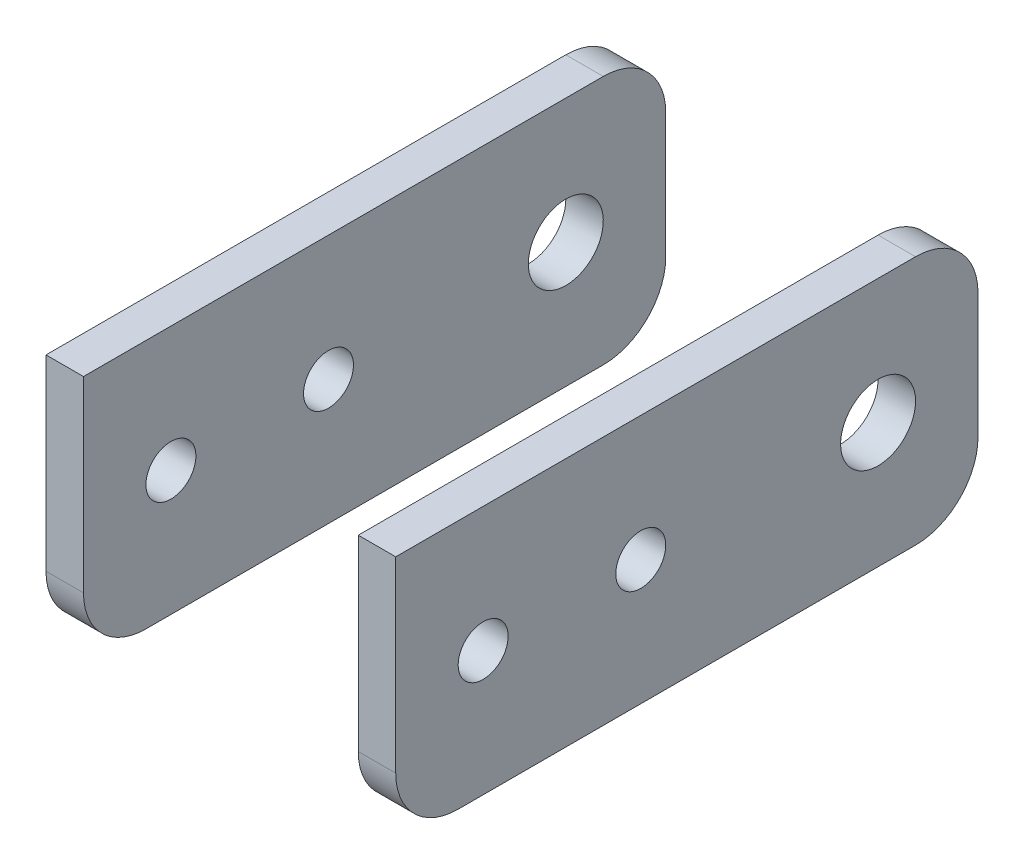
ISO-10303-21;
HEADER;
FILE_DESCRIPTION(('STEP AP214'),'2;1');
FILE_NAME('part.step','',(''),(''),'','','');
FILE_SCHEMA(('AUTOMOTIVE_DESIGN { 1 0 10303 214 1 1 1 1 }'));
ENDSEC;
DATA;
#1=APPLICATION_CONTEXT('core data for automotive mechanical design processes');
#2=APPLICATION_PROTOCOL_DEFINITION('international standard','automotive_design',2000,#1);
#3=PRODUCT_CONTEXT('',#1,'mechanical');
#4=PRODUCT('Part','Part','',(#3));
#5=PRODUCT_RELATED_PRODUCT_CATEGORY('part','',(#4));
#6=PRODUCT_DEFINITION_FORMATION('','',#4);
#7=PRODUCT_DEFINITION_CONTEXT('part definition',#1,'design');
#8=PRODUCT_DEFINITION('design','',#6,#7);
#9=PRODUCT_DEFINITION_SHAPE('','',#8);
#10=(LENGTH_UNIT() NAMED_UNIT(*) SI_UNIT(.MILLI.,.METRE.));
#11=(NAMED_UNIT(*) PLANE_ANGLE_UNIT() SI_UNIT($,.RADIAN.));
#12=(NAMED_UNIT(*) SI_UNIT($,.STERADIAN.) SOLID_ANGLE_UNIT());
#13=UNCERTAINTY_MEASURE_WITH_UNIT(LENGTH_MEASURE(1.E-05),#10,'distance_accuracy_value','');
#14=(GEOMETRIC_REPRESENTATION_CONTEXT(3) GLOBAL_UNCERTAINTY_ASSIGNED_CONTEXT((#13)) GLOBAL_UNIT_ASSIGNED_CONTEXT((#10,
#11,#12)) REPRESENTATION_CONTEXT('',''));
#15=CARTESIAN_POINT('',(0.,0.,0.));
#16=DIRECTION('',(0.,0.,1.));
#17=DIRECTION('',(1.,0.,0.));
#18=AXIS2_PLACEMENT_3D('',#15,#16,#17);
#19=CARTESIAN_POINT('',(14.,5.,-10.));
#20=DIRECTION('',(-1.,0.,0.));
#21=DIRECTION('',(0.,0.,1.));
#22=AXIS2_PLACEMENT_3D('',#19,#20,#21);
#23=CYLINDRICAL_SURFACE('',#22,5.);
#24=DIRECTION('',(-1.,0.,0.));
#25=VECTOR('',#24,1.);
#26=CARTESIAN_POINT('',(14.,5.00000000000004,-15.));
#27=LINE('',#26,#25);
#28=CARTESIAN_POINT('',(-11.,5.00000000000004,-15.));
#29=VERTEX_POINT('',#28);
#30=CARTESIAN_POINT('',(-14.,5.00000000000004,-15.));
#31=VERTEX_POINT('',#30);
#32=EDGE_CURVE('E135',#29,#31,#27,.T.);
#33=ORIENTED_EDGE('',*,*,#32,.F.);
#34=CARTESIAN_POINT('',(-11.,5.,-10.));
#35=DIRECTION('',(-1.,0.,0.));
#36=DIRECTION('',(0.,-1.,0.));
#37=AXIS2_PLACEMENT_3D('',#34,#35,#36);
#38=CIRCLE('',#37,5.);
#39=CARTESIAN_POINT('',(-11.,0.,-9.99999999999996));
#40=VERTEX_POINT('',#39);
#41=EDGE_CURVE('E63',#29,#40,#38,.T.);
#42=ORIENTED_EDGE('',*,*,#41,.T.);
#43=DIRECTION('',(-1.,0.,0.));
#44=VECTOR('',#43,1.);
#45=CARTESIAN_POINT('',(14.,0.,-9.99999999999996));
#46=LINE('',#45,#44);
#47=CARTESIAN_POINT('',(-14.,0.,-9.99999999999996));
#48=VERTEX_POINT('',#47);
#49=EDGE_CURVE('E138',#40,#48,#46,.T.);
#50=ORIENTED_EDGE('',*,*,#49,.T.);
#51=CARTESIAN_POINT('',(-14.,5.,-10.));
#52=DIRECTION('',(1.,0.,0.));
#53=DIRECTION('',(0.,0.,1.));
#54=AXIS2_PLACEMENT_3D('',#51,#52,#53);
#55=CIRCLE('',#54,5.);
#56=EDGE_CURVE('E136',#48,#31,#55,.T.);
#57=ORIENTED_EDGE('',*,*,#56,.T.);
#58=EDGE_LOOP('',(#33,#42,#50,#57));
#59=FACE_BOUND('',#58,.T.);
#60=ADVANCED_FACE('F44',(#59),#23,.T.);
#61=CARTESIAN_POINT('',(14.,15.,-15.));
#62=DIRECTION('',(0.,0.,1.));
#63=DIRECTION('',(0.,-1.,0.));
#64=AXIS2_PLACEMENT_3D('',#61,#62,#63);
#65=PLANE('',#64);
#66=DIRECTION('',(-1.,0.,0.));
#67=VECTOR('',#66,1.);
#68=CARTESIAN_POINT('',(14.,15.,-15.));
#69=LINE('',#68,#67);
#70=CARTESIAN_POINT('',(-11.,15.,-15.));
#71=VERTEX_POINT('',#70);
#72=CARTESIAN_POINT('',(-14.,15.,-15.));
#73=VERTEX_POINT('',#72);
#74=EDGE_CURVE('E143',#71,#73,#69,.T.);
#75=ORIENTED_EDGE('',*,*,#74,.F.);
#76=DIRECTION('',(0.,-1.,0.));
#77=VECTOR('',#76,1.);
#78=CARTESIAN_POINT('',(-11.,20.,-15.));
#79=LINE('',#78,#77);
#80=EDGE_CURVE('E134',#71,#29,#79,.T.);
#81=ORIENTED_EDGE('',*,*,#80,.T.);
#82=ORIENTED_EDGE('',*,*,#32,.T.);
#83=DIRECTION('',(0.,1.,0.));
#84=VECTOR('',#83,1.);
#85=CARTESIAN_POINT('',(-14.,15.,-15.));
#86=LINE('',#85,#84);
#87=EDGE_CURVE('E142',#31,#73,#86,.T.);
#88=ORIENTED_EDGE('',*,*,#87,.T.);
#89=EDGE_LOOP('',(#75,#81,#82,#88));
#90=FACE_BOUND('',#89,.T.);
#91=ADVANCED_FACE('F190',(#90),#65,.F.);
#92=CARTESIAN_POINT('',(14.,15.,-10.));
#93=DIRECTION('',(-1.,0.,0.));
#94=DIRECTION('',(0.,0.,1.));
#95=AXIS2_PLACEMENT_3D('',#92,#93,#94);
#96=CYLINDRICAL_SURFACE('',#95,5.);
#97=DIRECTION('',(-1.,0.,0.));
#98=VECTOR('',#97,1.);
#99=CARTESIAN_POINT('',(14.,20.,-9.99999999999996));
#100=LINE('',#99,#98);
#101=CARTESIAN_POINT('',(-11.,20.,-9.99999999999996));
#102=VERTEX_POINT('',#101);
#103=CARTESIAN_POINT('',(-14.,20.,-9.99999999999996));
#104=VERTEX_POINT('',#103);
#105=EDGE_CURVE('E110',#102,#104,#100,.T.);
#106=ORIENTED_EDGE('',*,*,#105,.F.);
#107=CARTESIAN_POINT('',(-11.,15.,-10.));
#108=DIRECTION('',(-1.,0.,0.));
#109=DIRECTION('',(0.,-1.,0.));
#110=AXIS2_PLACEMENT_3D('',#107,#108,#109);
#111=CIRCLE('',#110,5.);
#112=EDGE_CURVE('E85',#102,#71,#111,.T.);
#113=ORIENTED_EDGE('',*,*,#112,.T.);
#114=ORIENTED_EDGE('',*,*,#74,.T.);
#115=CARTESIAN_POINT('',(-14.,15.,-10.));
#116=DIRECTION('',(1.,0.,0.));
#117=DIRECTION('',(0.,0.,1.));
#118=AXIS2_PLACEMENT_3D('',#115,#116,#117);
#119=CIRCLE('',#118,5.);
#120=EDGE_CURVE('E145',#73,#104,#119,.T.);
#121=ORIENTED_EDGE('',*,*,#120,.T.);
#122=EDGE_LOOP('',(#106,#113,#114,#121));
#123=FACE_BOUND('',#122,.T.);
#124=ADVANCED_FACE('F188',(#123),#96,.T.);
#125=CARTESIAN_POINT('',(14.,20.,-5.00000000000004));
#126=DIRECTION('',(0.,-1.,0.));
#127=DIRECTION('',(0.,0.,-1.));
#128=AXIS2_PLACEMENT_3D('',#125,#126,#127);
#129=PLANE('',#128);
#130=DIRECTION('',(-1.,0.,0.));
#131=VECTOR('',#130,1.);
#132=CARTESIAN_POINT('',(14.,20.,31.6168828901481));
#133=LINE('',#132,#131);
#134=CARTESIAN_POINT('',(-11.,20.,31.6168828901481));
#135=VERTEX_POINT('',#134);
#136=CARTESIAN_POINT('',(-14.,20.,31.6168828901481));
#137=VERTEX_POINT('',#136);
#138=EDGE_CURVE('E98',#135,#137,#133,.T.);
#139=ORIENTED_EDGE('',*,*,#138,.F.);
#140=DIRECTION('',(0.,0.,1.));
#141=VECTOR('',#140,1.);
#142=CARTESIAN_POINT('',(-11.,20.,-15.));
#143=LINE('',#142,#141);
#144=EDGE_CURVE('E54',#102,#135,#143,.T.);
#145=ORIENTED_EDGE('',*,*,#144,.F.);
#146=ORIENTED_EDGE('',*,*,#105,.T.);
#147=DIRECTION('',(0.,0.,1.));
#148=VECTOR('',#147,1.);
#149=CARTESIAN_POINT('',(-14.,20.,-5.00000000000004));
#150=LINE('',#149,#148);
#151=EDGE_CURVE('E104',#104,#137,#150,.T.);
#152=ORIENTED_EDGE('',*,*,#151,.T.);
#153=EDGE_LOOP('',(#139,#145,#146,#152));
#154=FACE_BOUND('',#153,.T.);
#155=ADVANCED_FACE('F102',(#154),#129,.F.);
#156=CARTESIAN_POINT('',(14.,5.,31.6168828901481));
#157=DIRECTION('',(0.,0.,-1.));
#158=DIRECTION('',(-1.,0.,0.));
#159=AXIS2_PLACEMENT_3D('',#156,#157,#158);
#160=PLANE('',#159);
#161=DIRECTION('',(-1.,0.,0.));
#162=VECTOR('',#161,1.);
#163=CARTESIAN_POINT('',(14.,5.,31.6168828901481));
#164=LINE('',#163,#162);
#165=CARTESIAN_POINT('',(-11.,5.,31.6168828901481));
#166=VERTEX_POINT('',#165);
#167=CARTESIAN_POINT('',(-14.,5.,31.6168828901481));
#168=VERTEX_POINT('',#167);
#169=EDGE_CURVE('E101',#166,#168,#164,.T.);
#170=ORIENTED_EDGE('',*,*,#169,.F.);
#171=DIRECTION('',(0.,-1.,0.));
#172=VECTOR('',#171,1.);
#173=CARTESIAN_POINT('',(-11.,20.,31.6168828901481));
#174=LINE('',#173,#172);
#175=EDGE_CURVE('E12',#135,#166,#174,.T.);
#176=ORIENTED_EDGE('',*,*,#175,.F.);
#177=ORIENTED_EDGE('',*,*,#138,.T.);
#178=DIRECTION('',(0.,-1.,0.));
#179=VECTOR('',#178,1.);
#180=CARTESIAN_POINT('',(-14.,5.,31.6168828901481));
#181=LINE('',#180,#179);
#182=EDGE_CURVE('E106',#137,#168,#181,.T.);
#183=ORIENTED_EDGE('',*,*,#182,.T.);
#184=EDGE_LOOP('',(#170,#176,#177,#183));
#185=FACE_BOUND('',#184,.T.);
#186=ADVANCED_FACE('F95',(#185),#160,.F.);
#187=CARTESIAN_POINT('',(14.,5.,26.6168828901481));
#188=DIRECTION('',(-1.,0.,0.));
#189=DIRECTION('',(0.,0.,1.));
#190=AXIS2_PLACEMENT_3D('',#187,#188,#189);
#191=CYLINDRICAL_SURFACE('',#190,5.);
#192=DIRECTION('',(-1.,0.,0.));
#193=VECTOR('',#192,1.);
#194=CARTESIAN_POINT('',(14.,0.,26.6168828901481));
#195=LINE('',#194,#193);
#196=CARTESIAN_POINT('',(-11.,0.,26.6168828901481));
#197=VERTEX_POINT('',#196);
#198=CARTESIAN_POINT('',(-14.,0.,26.6168828901481));
#199=VERTEX_POINT('',#198);
#200=EDGE_CURVE('E48',#197,#199,#195,.T.);
#201=ORIENTED_EDGE('',*,*,#200,.F.);
#202=CARTESIAN_POINT('',(-11.,5.,26.6168828901481));
#203=DIRECTION('',(-1.,0.,0.));
#204=DIRECTION('',(0.,-1.,0.));
#205=AXIS2_PLACEMENT_3D('',#202,#203,#204);
#206=CIRCLE('',#205,5.);
#207=EDGE_CURVE('E108',#197,#166,#206,.T.);
#208=ORIENTED_EDGE('',*,*,#207,.T.);
#209=ORIENTED_EDGE('',*,*,#169,.T.);
#210=CARTESIAN_POINT('',(-14.,5.,26.6168828901481));
#211=DIRECTION('',(1.,0.,0.));
#212=DIRECTION('',(0.,0.,-1.));
#213=AXIS2_PLACEMENT_3D('',#210,#211,#212);
#214=CIRCLE('',#213,5.);
#215=EDGE_CURVE('E114',#168,#199,#214,.T.);
#216=ORIENTED_EDGE('',*,*,#215,.T.);
#217=EDGE_LOOP('',(#201,#208,#209,#216));
#218=FACE_BOUND('',#217,.T.);
#219=ADVANCED_FACE('F225',(#218),#191,.T.);
#220=CARTESIAN_POINT('',(14.,0.,0.));
#221=DIRECTION('',(0.,1.,0.));
#222=DIRECTION('',(0.,0.,1.));
#223=AXIS2_PLACEMENT_3D('',#220,#221,#222);
#224=PLANE('',#223);
#225=ORIENTED_EDGE('',*,*,#49,.F.);
#226=DIRECTION('',(0.,0.,1.));
#227=VECTOR('',#226,1.);
#228=CARTESIAN_POINT('',(-11.,0.,-15.));
#229=LINE('',#228,#227);
#230=EDGE_CURVE('E118',#40,#197,#229,.T.);
#231=ORIENTED_EDGE('',*,*,#230,.T.);
#232=ORIENTED_EDGE('',*,*,#200,.T.);
#233=DIRECTION('',(0.,0.,-1.));
#234=VECTOR('',#233,1.);
#235=CARTESIAN_POINT('',(-14.,0.,0.));
#236=LINE('',#235,#234);
#237=EDGE_CURVE('E165',#199,#48,#236,.T.);
#238=ORIENTED_EDGE('',*,*,#237,.T.);
#239=EDGE_LOOP('',(#225,#231,#232,#238));
#240=FACE_BOUND('',#239,.T.);
#241=ADVANCED_FACE('F172',(#240),#224,.F.);
#242=CARTESIAN_POINT('',(14.,10.,24.6168828901481));
#243=DIRECTION('',(-1.,0.,0.));
#244=DIRECTION('',(0.,0.,1.));
#245=AXIS2_PLACEMENT_3D('',#242,#243,#244);
#246=CYLINDRICAL_SURFACE('',#245,2.);
#247=CARTESIAN_POINT('',(-11.,10.,24.6168828901481));
#248=DIRECTION('',(-1.,0.,0.));
#249=DIRECTION('',(0.,-1.,0.));
#250=AXIS2_PLACEMENT_3D('',#247,#248,#249);
#251=CIRCLE('',#250,2.);
#252=CARTESIAN_POINT('',(-11.,8.,24.6168828901481));
#253=VERTEX_POINT('',#252);
#254=EDGE_CURVE('E125',#253,#253,#251,.T.);
#255=ORIENTED_EDGE('',*,*,#254,.F.);
#256=EDGE_LOOP('',(#255));
#257=FACE_BOUND('',#256,.T.);
#258=CARTESIAN_POINT('',(-14.,10.,24.6168828901481));
#259=DIRECTION('',(1.,0.,0.));
#260=DIRECTION('',(0.,0.,-1.));
#261=AXIS2_PLACEMENT_3D('',#258,#259,#260);
#262=CIRCLE('',#261,2.);
#263=CARTESIAN_POINT('',(-14.,10.,22.6168828901481));
#264=VERTEX_POINT('',#263);
#265=EDGE_CURVE('E159',#264,#264,#262,.T.);
#266=ORIENTED_EDGE('',*,*,#265,.F.);
#267=EDGE_LOOP('',(#266));
#268=FACE_BOUND('',#267,.T.);
#269=ADVANCED_FACE('F242',(#257,#268),#246,.F.);
#270=CARTESIAN_POINT('',(14.,10.,12.));
#271=DIRECTION('',(-1.,0.,0.));
#272=DIRECTION('',(0.,0.,1.));
#273=AXIS2_PLACEMENT_3D('',#270,#271,#272);
#274=CYLINDRICAL_SURFACE('',#273,2.);
#275=CARTESIAN_POINT('',(-11.,10.,12.));
#276=DIRECTION('',(-1.,0.,0.));
#277=DIRECTION('',(0.,-1.,0.));
#278=AXIS2_PLACEMENT_3D('',#275,#276,#277);
#279=CIRCLE('',#278,2.);
#280=CARTESIAN_POINT('',(-11.,8.,12.));
#281=VERTEX_POINT('',#280);
#282=EDGE_CURVE('E128',#281,#281,#279,.T.);
#283=ORIENTED_EDGE('',*,*,#282,.F.);
#284=EDGE_LOOP('',(#283));
#285=FACE_BOUND('',#284,.T.);
#286=CARTESIAN_POINT('',(-14.,10.,12.));
#287=DIRECTION('',(1.,0.,0.));
#288=DIRECTION('',(0.,0.,-1.));
#289=AXIS2_PLACEMENT_3D('',#286,#287,#288);
#290=CIRCLE('',#289,2.);
#291=CARTESIAN_POINT('',(-14.,10.,9.99999999999999));
#292=VERTEX_POINT('',#291);
#293=EDGE_CURVE('E162',#292,#292,#290,.T.);
#294=ORIENTED_EDGE('',*,*,#293,.F.);
#295=EDGE_LOOP('',(#294));
#296=FACE_BOUND('',#295,.T.);
#297=ADVANCED_FACE('F252',(#285,#296),#274,.F.);
#298=CARTESIAN_POINT('',(14.,10.,-7.));
#299=DIRECTION('',(-1.,0.,0.));
#300=DIRECTION('',(0.,0.,1.));
#301=AXIS2_PLACEMENT_3D('',#298,#299,#300);
#302=CYLINDRICAL_SURFACE('',#301,3.);
#303=CARTESIAN_POINT('',(-11.,10.,-7.));
#304=DIRECTION('',(-1.,0.,0.));
#305=DIRECTION('',(0.,-1.,0.));
#306=AXIS2_PLACEMENT_3D('',#303,#304,#305);
#307=CIRCLE('',#306,3.);
#308=CARTESIAN_POINT('',(-11.,7.,-7.));
#309=VERTEX_POINT('',#308);
#310=EDGE_CURVE('E90',#309,#309,#307,.T.);
#311=ORIENTED_EDGE('',*,*,#310,.F.);
#312=EDGE_LOOP('',(#311));
#313=FACE_BOUND('',#312,.T.);
#314=CARTESIAN_POINT('',(-14.,10.,-7.));
#315=DIRECTION('',(1.,0.,0.));
#316=DIRECTION('',(0.,0.,-1.));
#317=AXIS2_PLACEMENT_3D('',#314,#315,#316);
#318=CIRCLE('',#317,3.);
#319=CARTESIAN_POINT('',(-14.,10.,-10.));
#320=VERTEX_POINT('',#319);
#321=EDGE_CURVE('E129',#320,#320,#318,.T.);
#322=ORIENTED_EDGE('',*,*,#321,.F.);
#323=EDGE_LOOP('',(#322));
#324=FACE_BOUND('',#323,.T.);
#325=ADVANCED_FACE('F46',(#313,#324),#302,.F.);
#326=CARTESIAN_POINT('',(-14.,5.,-10.));
#327=DIRECTION('',(-1.,0.,0.));
#328=DIRECTION('',(0.,0.,1.));
#329=AXIS2_PLACEMENT_3D('',#326,#327,#328);
#330=PLANE('',#329);
#331=ORIENTED_EDGE('',*,*,#293,.T.);
#332=EDGE_LOOP('',(#331));
#333=FACE_BOUND('',#332,.T.);
#334=ORIENTED_EDGE('',*,*,#56,.F.);
#335=ORIENTED_EDGE('',*,*,#237,.F.);
#336=ORIENTED_EDGE('',*,*,#215,.F.);
#337=ORIENTED_EDGE('',*,*,#182,.F.);
#338=ORIENTED_EDGE('',*,*,#151,.F.);
#339=ORIENTED_EDGE('',*,*,#120,.F.);
#340=ORIENTED_EDGE('',*,*,#87,.F.);
#341=EDGE_LOOP('',(#334,#335,#336,#337,#338,#339,#340));
#342=FACE_BOUND('',#341,.T.);
#343=ORIENTED_EDGE('',*,*,#265,.T.);
#344=EDGE_LOOP('',(#343));
#345=FACE_BOUND('',#344,.T.);
#346=ORIENTED_EDGE('',*,*,#321,.T.);
#347=EDGE_LOOP('',(#346));
#348=FACE_BOUND('',#347,.T.);
#349=ADVANCED_FACE('F180',(#333,#342,#345,#348),#330,.T.);
#350=CARTESIAN_POINT('',(-11.,20.,-15.));
#351=DIRECTION('',(-1.,0.,0.));
#352=DIRECTION('',(0.,-1.,0.));
#353=AXIS2_PLACEMENT_3D('',#350,#351,#352);
#354=PLANE('',#353);
#355=ORIENTED_EDGE('',*,*,#254,.T.);
#356=EDGE_LOOP('',(#355));
#357=FACE_BOUND('',#356,.T.);
#358=ORIENTED_EDGE('',*,*,#282,.T.);
#359=EDGE_LOOP('',(#358));
#360=FACE_BOUND('',#359,.T.);
#361=ORIENTED_EDGE('',*,*,#310,.T.);
#362=EDGE_LOOP('',(#361));
#363=FACE_BOUND('',#362,.T.);
#364=ORIENTED_EDGE('',*,*,#80,.F.);
#365=ORIENTED_EDGE('',*,*,#112,.F.);
#366=ORIENTED_EDGE('',*,*,#144,.T.);
#367=ORIENTED_EDGE('',*,*,#175,.T.);
#368=ORIENTED_EDGE('',*,*,#207,.F.);
#369=ORIENTED_EDGE('',*,*,#230,.F.);
#370=ORIENTED_EDGE('',*,*,#41,.F.);
#371=EDGE_LOOP('',(#364,#365,#366,#367,#368,#369,#370));
#372=FACE_BOUND('',#371,.T.);
#373=ADVANCED_FACE('F83',(#357,#360,#363,#372),#354,.F.);
#374=CLOSED_SHELL('',(#60,#91,#124,#155,#186,#219,#241,#269,#297,#325,#349,#373));
#375=MANIFOLD_SOLID_BREP('B2',#374);
#376=CARTESIAN_POINT('',(14.,10.,12.));
#377=DIRECTION('',(-1.,0.,0.));
#378=DIRECTION('',(0.,0.,1.));
#379=AXIS2_PLACEMENT_3D('',#376,#377,#378);
#380=CYLINDRICAL_SURFACE('',#379,2.);
#381=CARTESIAN_POINT('',(11.,10.,12.));
#382=DIRECTION('',(1.,0.,0.));
#383=DIRECTION('',(0.,1.,0.));
#384=AXIS2_PLACEMENT_3D('',#381,#382,#383);
#385=CIRCLE('',#384,2.);
#386=CARTESIAN_POINT('',(11.,12.,12.));
#387=VERTEX_POINT('',#386);
#388=EDGE_CURVE('E450',#387,#387,#385,.T.);
#389=ORIENTED_EDGE('',*,*,#388,.F.);
#390=EDGE_LOOP('',(#389));
#391=FACE_BOUND('',#390,.T.);
#392=CARTESIAN_POINT('',(14.,10.,12.));
#393=DIRECTION('',(1.,0.,0.));
#394=DIRECTION('',(0.,0.,-1.));
#395=AXIS2_PLACEMENT_3D('',#392,#393,#394);
#396=CIRCLE('',#395,2.);
#397=CARTESIAN_POINT('',(14.,10.,9.99999999999999));
#398=VERTEX_POINT('',#397);
#399=EDGE_CURVE('E424',#398,#398,#396,.T.);
#400=ORIENTED_EDGE('',*,*,#399,.T.);
#401=EDGE_LOOP('',(#400));
#402=FACE_BOUND('',#401,.T.);
#403=ADVANCED_FACE('F314',(#391,#402),#380,.F.);
#404=CARTESIAN_POINT('',(14.,10.,24.6168828901481));
#405=DIRECTION('',(-1.,0.,0.));
#406=DIRECTION('',(0.,0.,1.));
#407=AXIS2_PLACEMENT_3D('',#404,#405,#406);
#408=CYLINDRICAL_SURFACE('',#407,2.);
#409=CARTESIAN_POINT('',(11.,10.,24.6168828901481));
#410=DIRECTION('',(1.,0.,0.));
#411=DIRECTION('',(0.,1.,0.));
#412=AXIS2_PLACEMENT_3D('',#409,#410,#411);
#413=CIRCLE('',#412,2.);
#414=CARTESIAN_POINT('',(11.,12.,24.6168828901481));
#415=VERTEX_POINT('',#414);
#416=EDGE_CURVE('E448',#415,#415,#413,.T.);
#417=ORIENTED_EDGE('',*,*,#416,.F.);
#418=EDGE_LOOP('',(#417));
#419=FACE_BOUND('',#418,.T.);
#420=CARTESIAN_POINT('',(14.,10.,24.6168828901481));
#421=DIRECTION('',(1.,0.,0.));
#422=DIRECTION('',(0.,0.,-1.));
#423=AXIS2_PLACEMENT_3D('',#420,#421,#422);
#424=CIRCLE('',#423,2.);
#425=CARTESIAN_POINT('',(14.,10.,22.6168828901481));
#426=VERTEX_POINT('',#425);
#427=EDGE_CURVE('E431',#426,#426,#424,.T.);
#428=ORIENTED_EDGE('',*,*,#427,.T.);
#429=EDGE_LOOP('',(#428));
#430=FACE_BOUND('',#429,.T.);
#431=ADVANCED_FACE('F479',(#419,#430),#408,.F.);
#432=CARTESIAN_POINT('',(14.,0.,0.));
#433=DIRECTION('',(0.,1.,0.));
#434=DIRECTION('',(0.,0.,1.));
#435=AXIS2_PLACEMENT_3D('',#432,#433,#434);
#436=PLANE('',#435);
#437=DIRECTION('',(-1.,0.,0.));
#438=VECTOR('',#437,1.);
#439=CARTESIAN_POINT('',(14.,0.,26.6168828901481));
#440=LINE('',#439,#438);
#441=CARTESIAN_POINT('',(14.,0.,26.6168828901481));
#442=VERTEX_POINT('',#441);
#443=CARTESIAN_POINT('',(11.,0.,26.6168828901481));
#444=VERTEX_POINT('',#443);
#445=EDGE_CURVE('E404',#442,#444,#440,.T.);
#446=ORIENTED_EDGE('',*,*,#445,.T.);
#447=DIRECTION('',(0.,0.,1.));
#448=VECTOR('',#447,1.);
#449=CARTESIAN_POINT('',(11.,0.,-15.));
#450=LINE('',#449,#448);
#451=CARTESIAN_POINT('',(11.,0.,-9.99999999999996));
#452=VERTEX_POINT('',#451);
#453=EDGE_CURVE('E396',#452,#444,#450,.T.);
#454=ORIENTED_EDGE('',*,*,#453,.F.);
#455=DIRECTION('',(-1.,0.,0.));
#456=VECTOR('',#455,1.);
#457=CARTESIAN_POINT('',(14.,0.,-9.99999999999996));
#458=LINE('',#457,#456);
#459=CARTESIAN_POINT('',(14.,0.,-9.99999999999996));
#460=VERTEX_POINT('',#459);
#461=EDGE_CURVE('E42',#460,#452,#458,.T.);
#462=ORIENTED_EDGE('',*,*,#461,.F.);
#463=DIRECTION('',(0.,0.,-1.));
#464=VECTOR('',#463,1.);
#465=CARTESIAN_POINT('',(14.,0.,0.));
#466=LINE('',#465,#464);
#467=EDGE_CURVE('E338',#442,#460,#466,.T.);
#468=ORIENTED_EDGE('',*,*,#467,.F.);
#469=EDGE_LOOP('',(#446,#454,#462,#468));
#470=FACE_BOUND('',#469,.T.);
#471=ADVANCED_FACE('F444',(#470),#436,.F.);
#472=CARTESIAN_POINT('',(14.,5.,26.6168828901481));
#473=DIRECTION('',(-1.,0.,0.));
#474=DIRECTION('',(0.,0.,1.));
#475=AXIS2_PLACEMENT_3D('',#472,#473,#474);
#476=CYLINDRICAL_SURFACE('',#475,5.);
#477=DIRECTION('',(-1.,0.,0.));
#478=VECTOR('',#477,1.);
#479=CARTESIAN_POINT('',(14.,5.,31.6168828901481));
#480=LINE('',#479,#478);
#481=CARTESIAN_POINT('',(14.,5.,31.6168828901481));
#482=VERTEX_POINT('',#481);
#483=CARTESIAN_POINT('',(11.,5.,31.6168828901481));
#484=VERTEX_POINT('',#483);
#485=EDGE_CURVE('E400',#482,#484,#480,.T.);
#486=ORIENTED_EDGE('',*,*,#485,.T.);
#487=CARTESIAN_POINT('',(11.,5.,26.6168828901481));
#488=DIRECTION('',(1.,0.,0.));
#489=DIRECTION('',(0.,1.,0.));
#490=AXIS2_PLACEMENT_3D('',#487,#488,#489);
#491=CIRCLE('',#490,5.);
#492=EDGE_CURVE('E380',#484,#444,#491,.T.);
#493=ORIENTED_EDGE('',*,*,#492,.T.);
#494=ORIENTED_EDGE('',*,*,#445,.F.);
#495=CARTESIAN_POINT('',(14.,5.,26.6168828901481));
#496=DIRECTION('',(1.,0.,0.));
#497=DIRECTION('',(0.,0.,-1.));
#498=AXIS2_PLACEMENT_3D('',#495,#496,#497);
#499=CIRCLE('',#498,5.);
#500=EDGE_CURVE('E442',#482,#442,#499,.T.);
#501=ORIENTED_EDGE('',*,*,#500,.F.);
#502=EDGE_LOOP('',(#486,#493,#494,#501));
#503=FACE_BOUND('',#502,.T.);
#504=ADVANCED_FACE('F447',(#503),#476,.T.);
#505=CARTESIAN_POINT('',(14.,5.,31.6168828901481));
#506=DIRECTION('',(0.,0.,-1.));
#507=DIRECTION('',(-1.,0.,0.));
#508=AXIS2_PLACEMENT_3D('',#505,#506,#507);
#509=PLANE('',#508);
#510=DIRECTION('',(-1.,0.,0.));
#511=VECTOR('',#510,1.);
#512=CARTESIAN_POINT('',(14.,20.,31.6168828901481));
#513=LINE('',#512,#511);
#514=CARTESIAN_POINT('',(14.,20.,31.6168828901481));
#515=VERTEX_POINT('',#514);
#516=CARTESIAN_POINT('',(11.,20.,31.6168828901481));
#517=VERTEX_POINT('',#516);
#518=EDGE_CURVE('E392',#515,#517,#513,.T.);
#519=ORIENTED_EDGE('',*,*,#518,.T.);
#520=DIRECTION('',(0.,1.,0.));
#521=VECTOR('',#520,1.);
#522=CARTESIAN_POINT('',(11.,20.,31.6168828901481));
#523=LINE('',#522,#521);
#524=EDGE_CURVE('E374',#484,#517,#523,.T.);
#525=ORIENTED_EDGE('',*,*,#524,.F.);
#526=ORIENTED_EDGE('',*,*,#485,.F.);
#527=DIRECTION('',(0.,-1.,0.));
#528=VECTOR('',#527,1.);
#529=CARTESIAN_POINT('',(14.,5.,31.6168828901481));
#530=LINE('',#529,#528);
#531=EDGE_CURVE('E399',#515,#482,#530,.T.);
#532=ORIENTED_EDGE('',*,*,#531,.F.);
#533=EDGE_LOOP('',(#519,#525,#526,#532));
#534=FACE_BOUND('',#533,.T.);
#535=ADVANCED_FACE('F398',(#534),#509,.F.);
#536=CARTESIAN_POINT('',(14.,20.,-5.00000000000004));
#537=DIRECTION('',(0.,-1.,0.));
#538=DIRECTION('',(0.,0.,-1.));
#539=AXIS2_PLACEMENT_3D('',#536,#537,#538);
#540=PLANE('',#539);
#541=DIRECTION('',(-1.,0.,0.));
#542=VECTOR('',#541,1.);
#543=CARTESIAN_POINT('',(14.,20.,-9.99999999999996));
#544=LINE('',#543,#542);
#545=CARTESIAN_POINT('',(14.,20.,-9.99999999999996));
#546=VERTEX_POINT('',#545);
#547=CARTESIAN_POINT('',(11.,20.,-9.99999999999996));
#548=VERTEX_POINT('',#547);
#549=EDGE_CURVE('E395',#546,#548,#544,.T.);
#550=ORIENTED_EDGE('',*,*,#549,.T.);
#551=DIRECTION('',(0.,0.,1.));
#552=VECTOR('',#551,1.);
#553=CARTESIAN_POINT('',(11.,20.,-15.));
#554=LINE('',#553,#552);
#555=EDGE_CURVE('E377',#548,#517,#554,.T.);
#556=ORIENTED_EDGE('',*,*,#555,.T.);
#557=ORIENTED_EDGE('',*,*,#518,.F.);
#558=DIRECTION('',(0.,0.,1.));
#559=VECTOR('',#558,1.);
#560=CARTESIAN_POINT('',(14.,20.,-9.99999999999996));
#561=LINE('',#560,#559);
#562=EDGE_CURVE('E439',#546,#515,#561,.T.);
#563=ORIENTED_EDGE('',*,*,#562,.F.);
#564=EDGE_LOOP('',(#550,#556,#557,#563));
#565=FACE_BOUND('',#564,.T.);
#566=ADVANCED_FACE('F390',(#565),#540,.F.);
#567=CARTESIAN_POINT('',(14.,15.,-10.));
#568=DIRECTION('',(-1.,0.,0.));
#569=DIRECTION('',(0.,0.,1.));
#570=AXIS2_PLACEMENT_3D('',#567,#568,#569);
#571=CYLINDRICAL_SURFACE('',#570,5.);
#572=DIRECTION('',(-1.,0.,0.));
#573=VECTOR('',#572,1.);
#574=CARTESIAN_POINT('',(14.,15.,-15.));
#575=LINE('',#574,#573);
#576=CARTESIAN_POINT('',(14.,15.,-15.));
#577=VERTEX_POINT('',#576);
#578=CARTESIAN_POINT('',(11.,15.,-15.));
#579=VERTEX_POINT('',#578);
#580=EDGE_CURVE('E402',#577,#579,#575,.T.);
#581=ORIENTED_EDGE('',*,*,#580,.T.);
#582=CARTESIAN_POINT('',(11.,15.,-10.));
#583=DIRECTION('',(1.,0.,0.));
#584=DIRECTION('',(0.,1.,0.));
#585=AXIS2_PLACEMENT_3D('',#582,#583,#584);
#586=CIRCLE('',#585,5.);
#587=EDGE_CURVE('E421',#579,#548,#586,.T.);
#588=ORIENTED_EDGE('',*,*,#587,.T.);
#589=ORIENTED_EDGE('',*,*,#549,.F.);
#590=CARTESIAN_POINT('',(14.,15.,-10.));
#591=DIRECTION('',(1.,0.,0.));
#592=DIRECTION('',(0.,0.,1.));
#593=AXIS2_PLACEMENT_3D('',#590,#591,#592);
#594=CIRCLE('',#593,5.);
#595=EDGE_CURVE('E437',#577,#546,#594,.T.);
#596=ORIENTED_EDGE('',*,*,#595,.F.);
#597=EDGE_LOOP('',(#581,#588,#589,#596));
#598=FACE_BOUND('',#597,.T.);
#599=ADVANCED_FACE('F518',(#598),#571,.T.);
#600=CARTESIAN_POINT('',(14.,15.,-15.));
#601=DIRECTION('',(0.,0.,1.));
#602=DIRECTION('',(0.,-1.,0.));
#603=AXIS2_PLACEMENT_3D('',#600,#601,#602);
#604=PLANE('',#603);
#605=DIRECTION('',(-1.,0.,0.));
#606=VECTOR('',#605,1.);
#607=CARTESIAN_POINT('',(14.,5.00000000000004,-15.));
#608=LINE('',#607,#606);
#609=CARTESIAN_POINT('',(14.,5.00000000000004,-15.));
#610=VERTEX_POINT('',#609);
#611=CARTESIAN_POINT('',(11.,5.00000000000004,-15.));
#612=VERTEX_POINT('',#611);
#613=EDGE_CURVE('E323',#610,#612,#608,.T.);
#614=ORIENTED_EDGE('',*,*,#613,.T.);
#615=DIRECTION('',(0.,1.,0.));
#616=VECTOR('',#615,1.);
#617=CARTESIAN_POINT('',(11.,20.,-15.));
#618=LINE('',#617,#616);
#619=EDGE_CURVE('E385',#612,#579,#618,.T.);
#620=ORIENTED_EDGE('',*,*,#619,.T.);
#621=ORIENTED_EDGE('',*,*,#580,.F.);
#622=DIRECTION('',(0.,1.,0.));
#623=VECTOR('',#622,1.);
#624=CARTESIAN_POINT('',(14.,15.,-15.));
#625=LINE('',#624,#623);
#626=EDGE_CURVE('E417',#610,#577,#625,.T.);
#627=ORIENTED_EDGE('',*,*,#626,.F.);
#628=EDGE_LOOP('',(#614,#620,#621,#627));
#629=FACE_BOUND('',#628,.T.);
#630=ADVANCED_FACE('F415',(#629),#604,.F.);
#631=CARTESIAN_POINT('',(14.,5.,-10.));
#632=DIRECTION('',(-1.,0.,0.));
#633=DIRECTION('',(0.,0.,1.));
#634=AXIS2_PLACEMENT_3D('',#631,#632,#633);
#635=CYLINDRICAL_SURFACE('',#634,5.);
#636=ORIENTED_EDGE('',*,*,#461,.T.);
#637=CARTESIAN_POINT('',(11.,5.,-10.));
#638=DIRECTION('',(1.,0.,0.));
#639=DIRECTION('',(0.,1.,0.));
#640=AXIS2_PLACEMENT_3D('',#637,#638,#639);
#641=CIRCLE('',#640,5.);
#642=EDGE_CURVE('E330',#452,#612,#641,.T.);
#643=ORIENTED_EDGE('',*,*,#642,.T.);
#644=ORIENTED_EDGE('',*,*,#613,.F.);
#645=CARTESIAN_POINT('',(14.,5.,-10.));
#646=DIRECTION('',(1.,0.,0.));
#647=DIRECTION('',(0.,0.,1.));
#648=AXIS2_PLACEMENT_3D('',#645,#646,#647);
#649=CIRCLE('',#648,5.);
#650=EDGE_CURVE('E419',#460,#610,#649,.T.);
#651=ORIENTED_EDGE('',*,*,#650,.F.);
#652=EDGE_LOOP('',(#636,#643,#644,#651));
#653=FACE_BOUND('',#652,.T.);
#654=ADVANCED_FACE('F316',(#653),#635,.T.);
#655=CARTESIAN_POINT('',(14.,5.,-10.));
#656=DIRECTION('',(-1.,0.,0.));
#657=DIRECTION('',(0.,0.,1.));
#658=AXIS2_PLACEMENT_3D('',#655,#656,#657);
#659=PLANE('',#658);
#660=ORIENTED_EDGE('',*,*,#467,.T.);
#661=ORIENTED_EDGE('',*,*,#650,.T.);
#662=ORIENTED_EDGE('',*,*,#626,.T.);
#663=ORIENTED_EDGE('',*,*,#595,.T.);
#664=ORIENTED_EDGE('',*,*,#562,.T.);
#665=ORIENTED_EDGE('',*,*,#531,.T.);
#666=ORIENTED_EDGE('',*,*,#500,.T.);
#667=EDGE_LOOP('',(#660,#661,#662,#663,#664,#665,#666));
#668=FACE_BOUND('',#667,.T.);
#669=ORIENTED_EDGE('',*,*,#427,.F.);
#670=EDGE_LOOP('',(#669));
#671=FACE_BOUND('',#670,.T.);
#672=ORIENTED_EDGE('',*,*,#399,.F.);
#673=EDGE_LOOP('',(#672));
#674=FACE_BOUND('',#673,.T.);
#675=CARTESIAN_POINT('',(14.,10.,-7.));
#676=DIRECTION('',(1.,0.,0.));
#677=DIRECTION('',(0.,0.,-1.));
#678=AXIS2_PLACEMENT_3D('',#675,#676,#677);
#679=CIRCLE('',#678,3.);
#680=CARTESIAN_POINT('',(14.,10.,-10.));
#681=VERTEX_POINT('',#680);
#682=EDGE_CURVE('E420',#681,#681,#679,.T.);
#683=ORIENTED_EDGE('',*,*,#682,.F.);
#684=EDGE_LOOP('',(#683));
#685=FACE_BOUND('',#684,.T.);
#686=ADVANCED_FACE('F465',(#668,#671,#674,#685),#659,.F.);
#687=CARTESIAN_POINT('',(14.,10.,-7.));
#688=DIRECTION('',(-1.,0.,0.));
#689=DIRECTION('',(0.,0.,1.));
#690=AXIS2_PLACEMENT_3D('',#687,#688,#689);
#691=CYLINDRICAL_SURFACE('',#690,3.);
#692=CARTESIAN_POINT('',(11.,10.,-7.));
#693=DIRECTION('',(1.,0.,0.));
#694=DIRECTION('',(0.,1.,0.));
#695=AXIS2_PLACEMENT_3D('',#692,#693,#694);
#696=CIRCLE('',#695,3.);
#697=CARTESIAN_POINT('',(11.,13.,-7.));
#698=VERTEX_POINT('',#697);
#699=EDGE_CURVE('E318',#698,#698,#696,.T.);
#700=ORIENTED_EDGE('',*,*,#699,.F.);
#701=EDGE_LOOP('',(#700));
#702=FACE_BOUND('',#701,.T.);
#703=ORIENTED_EDGE('',*,*,#682,.T.);
#704=EDGE_LOOP('',(#703));
#705=FACE_BOUND('',#704,.T.);
#706=ADVANCED_FACE('F462',(#702,#705),#691,.F.);
#707=CARTESIAN_POINT('',(11.,20.,-15.));
#708=DIRECTION('',(1.,0.,0.));
#709=DIRECTION('',(0.,1.,0.));
#710=AXIS2_PLACEMENT_3D('',#707,#708,#709);
#711=PLANE('',#710);
#712=ORIENTED_EDGE('',*,*,#416,.T.);
#713=EDGE_LOOP('',(#712));
#714=FACE_BOUND('',#713,.T.);
#715=ORIENTED_EDGE('',*,*,#388,.T.);
#716=EDGE_LOOP('',(#715));
#717=FACE_BOUND('',#716,.T.);
#718=ORIENTED_EDGE('',*,*,#699,.T.);
#719=EDGE_LOOP('',(#718));
#720=FACE_BOUND('',#719,.T.);
#721=ORIENTED_EDGE('',*,*,#453,.T.);
#722=ORIENTED_EDGE('',*,*,#492,.F.);
#723=ORIENTED_EDGE('',*,*,#524,.T.);
#724=ORIENTED_EDGE('',*,*,#555,.F.);
#725=ORIENTED_EDGE('',*,*,#587,.F.);
#726=ORIENTED_EDGE('',*,*,#619,.F.);
#727=ORIENTED_EDGE('',*,*,#642,.F.);
#728=EDGE_LOOP('',(#721,#722,#723,#724,#725,#726,#727));
#729=FACE_BOUND('',#728,.T.);
#730=ADVANCED_FACE('F376',(#714,#717,#720,#729),#711,.F.);
#731=CLOSED_SHELL('',(#403,#431,#471,#504,#535,#566,#599,#630,#654,#686,#706,#730));
#732=MANIFOLD_SOLID_BREP('B6',#731);
#733=ADVANCED_BREP_SHAPE_REPRESENTATION('',(#18,#375,#732),#14);
#734=SHAPE_DEFINITION_REPRESENTATION(#9,#733);
ENDSEC;
END-ISO-10303-21;
